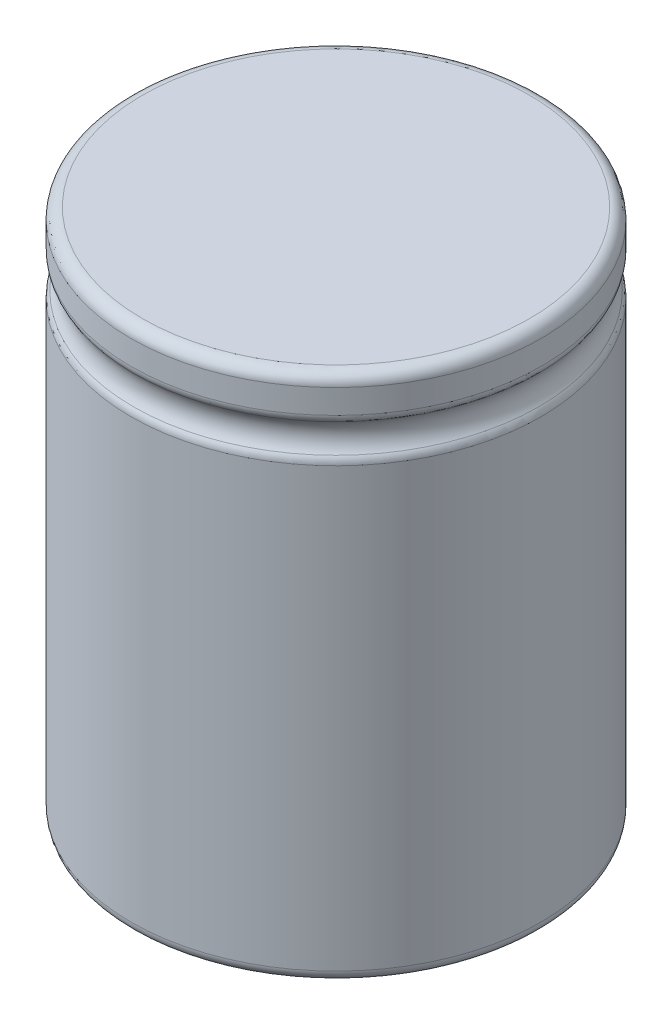
ISO-10303-21;
HEADER;
FILE_DESCRIPTION(('STEP AP214'),'2;1');
FILE_NAME('part.step','',(''),(''),'','','');
FILE_SCHEMA(('AUTOMOTIVE_DESIGN { 1 0 10303 214 1 1 1 1 }'));
ENDSEC;
DATA;
#1=APPLICATION_CONTEXT('core data for automotive mechanical design processes');
#2=APPLICATION_PROTOCOL_DEFINITION('international standard','automotive_design',2000,#1);
#3=PRODUCT_CONTEXT('',#1,'mechanical');
#4=PRODUCT('Part','Part','',(#3));
#5=PRODUCT_RELATED_PRODUCT_CATEGORY('part','',(#4));
#6=PRODUCT_DEFINITION_FORMATION('','',#4);
#7=PRODUCT_DEFINITION_CONTEXT('part definition',#1,'design');
#8=PRODUCT_DEFINITION('design','',#6,#7);
#9=PRODUCT_DEFINITION_SHAPE('','',#8);
#10=(LENGTH_UNIT() NAMED_UNIT(*) SI_UNIT(.MILLI.,.METRE.));
#11=(NAMED_UNIT(*) PLANE_ANGLE_UNIT() SI_UNIT($,.RADIAN.));
#12=(NAMED_UNIT(*) SI_UNIT($,.STERADIAN.) SOLID_ANGLE_UNIT());
#13=UNCERTAINTY_MEASURE_WITH_UNIT(LENGTH_MEASURE(1.E-05),#10,'distance_accuracy_value','');
#14=(GEOMETRIC_REPRESENTATION_CONTEXT(3) GLOBAL_UNCERTAINTY_ASSIGNED_CONTEXT((#13)) GLOBAL_UNIT_ASSIGNED_CONTEXT((#10,
#11,#12)) REPRESENTATION_CONTEXT('',''));
#15=CARTESIAN_POINT('',(0.,0.,0.));
#16=DIRECTION('',(0.,0.,1.));
#17=DIRECTION('',(1.,0.,0.));
#18=AXIS2_PLACEMENT_3D('',#15,#16,#17);
#19=CARTESIAN_POINT('',(0.,46.,0.));
#20=DIRECTION('',(0.,-1.,0.));
#21=DIRECTION('',(0.,0.,-1.));
#22=AXIS2_PLACEMENT_3D('',#19,#20,#21);
#23=CYLINDRICAL_SURFACE('',#22,17.85);
#24=CARTESIAN_POINT('',(0.,39.1015141062033,0.));
#25=DIRECTION('',(0.,1.,0.));
#26=DIRECTION('',(0.,0.,1.));
#27=AXIS2_PLACEMENT_3D('',#24,#25,#26);
#28=CIRCLE('',#27,17.85);
#29=CARTESIAN_POINT('',(0.,39.1015141062033,17.85));
#30=VERTEX_POINT('',#29);
#31=EDGE_CURVE('E48',#30,#30,#28,.F.);
#32=ORIENTED_EDGE('',*,*,#31,.T.);
#33=EDGE_LOOP('',(#32));
#34=FACE_BOUND('',#33,.T.);
#35=CARTESIAN_POINT('',(0.,1.,0.));
#36=DIRECTION('',(0.,1.,0.));
#37=DIRECTION('',(0.,0.,1.));
#38=AXIS2_PLACEMENT_3D('',#35,#36,#37);
#39=CIRCLE('',#38,17.85);
#40=CARTESIAN_POINT('',(0.,1.,17.85));
#41=VERTEX_POINT('',#40);
#42=EDGE_CURVE('E62',#41,#41,#39,.T.);
#43=ORIENTED_EDGE('',*,*,#42,.T.);
#44=EDGE_LOOP('',(#43));
#45=FACE_BOUND('',#44,.T.);
#46=ADVANCED_FACE('F33',(#34,#45),#23,.T.);
#47=CARTESIAN_POINT('',(0.,0.,0.));
#48=DIRECTION('',(0.,1.,0.));
#49=DIRECTION('',(0.,0.,1.));
#50=AXIS2_PLACEMENT_3D('',#47,#48,#49);
#51=PLANE('',#50);
#52=CARTESIAN_POINT('',(0.,0.,0.));
#53=DIRECTION('',(0.,1.,0.));
#54=DIRECTION('',(0.,0.,1.));
#55=AXIS2_PLACEMENT_3D('',#52,#53,#54);
#56=CIRCLE('',#55,16.85);
#57=CARTESIAN_POINT('',(0.,0.,16.85));
#58=VERTEX_POINT('',#57);
#59=EDGE_CURVE('E59',#58,#58,#56,.F.);
#60=ORIENTED_EDGE('',*,*,#59,.T.);
#61=EDGE_LOOP('',(#60));
#62=FACE_BOUND('',#61,.T.);
#63=ADVANCED_FACE('F84',(#62),#51,.F.);
#64=CARTESIAN_POINT('',(0.,41.,0.));
#65=DIRECTION('',(0.,-1.,0.));
#66=DIRECTION('',(0.,0.,-1.));
#67=AXIS2_PLACEMENT_3D('',#64,#65,#66);
#68=TOROIDAL_SURFACE('',#67,19.1728756555323,2.00000000000001);
#69=CARTESIAN_POINT('',(0.,39.7343427374693,0.));
#70=DIRECTION('',(0.,1.,0.));
#71=DIRECTION('',(0.,0.,1.));
#72=AXIS2_PLACEMENT_3D('',#69,#70,#71);
#73=CIRCLE('',#72,17.6242918851784);
#74=CARTESIAN_POINT('',(0.,39.7343427374693,17.6242918851784));
#75=VERTEX_POINT('',#74);
#76=EDGE_CURVE('E40',#75,#75,#73,.T.);
#77=ORIENTED_EDGE('',*,*,#76,.T.);
#78=EDGE_LOOP('',(#77));
#79=FACE_BOUND('',#78,.T.);
#80=CARTESIAN_POINT('',(0.,42.2656572625307,0.));
#81=DIRECTION('',(0.,-1.,0.));
#82=DIRECTION('',(0.,0.,-1.));
#83=AXIS2_PLACEMENT_3D('',#80,#81,#82);
#84=CIRCLE('',#83,17.6242918851785);
#85=CARTESIAN_POINT('',(0.,42.2656572625307,-17.6242918851785));
#86=VERTEX_POINT('',#85);
#87=EDGE_CURVE('E44',#86,#86,#84,.T.);
#88=ORIENTED_EDGE('',*,*,#87,.T.);
#89=EDGE_LOOP('',(#88));
#90=FACE_BOUND('',#89,.T.);
#91=ADVANCED_FACE('F89',(#79,#90),#68,.F.);
#92=CARTESIAN_POINT('',(0.,46.,0.));
#93=DIRECTION('',(0.,1.,0.));
#94=DIRECTION('',(0.,0.,1.));
#95=AXIS2_PLACEMENT_3D('',#92,#93,#94);
#96=PLANE('',#95);
#97=CARTESIAN_POINT('',(0.,46.,0.));
#98=DIRECTION('',(0.,1.,0.));
#99=DIRECTION('',(0.,0.,1.));
#100=AXIS2_PLACEMENT_3D('',#97,#98,#99);
#101=CIRCLE('',#100,16.85);
#102=CARTESIAN_POINT('',(0.,46.,16.85));
#103=VERTEX_POINT('',#102);
#104=EDGE_CURVE('E56',#103,#103,#101,.T.);
#105=ORIENTED_EDGE('',*,*,#104,.T.);
#106=EDGE_LOOP('',(#105));
#107=FACE_BOUND('',#106,.T.);
#108=ADVANCED_FACE('F80',(#107),#96,.T.);
#109=CARTESIAN_POINT('',(0.,42.8984858937966,0.));
#110=DIRECTION('',(0.,1.,0.));
#111=DIRECTION('',(0.,0.,1.));
#112=AXIS2_PLACEMENT_3D('',#109,#110,#111);
#113=CIRCLE('',#112,17.85);
#114=CARTESIAN_POINT('',(0.,42.8984858937966,17.85));
#115=VERTEX_POINT('',#114);
#116=EDGE_CURVE('E10',#115,#115,#113,.T.);
#117=ORIENTED_EDGE('',*,*,#116,.T.);
#118=EDGE_LOOP('',(#117));
#119=FACE_BOUND('',#118,.T.);
#120=CARTESIAN_POINT('',(0.,45.,0.));
#121=DIRECTION('',(0.,1.,0.));
#122=DIRECTION('',(0.,0.,1.));
#123=AXIS2_PLACEMENT_3D('',#120,#121,#122);
#124=CIRCLE('',#123,17.85);
#125=CARTESIAN_POINT('',(0.,45.,17.85));
#126=VERTEX_POINT('',#125);
#127=EDGE_CURVE('E53',#126,#126,#124,.F.);
#128=ORIENTED_EDGE('',*,*,#127,.T.);
#129=EDGE_LOOP('',(#128));
#130=FACE_BOUND('',#129,.T.);
#131=ADVANCED_FACE('F70',(#119,#130),#23,.T.);
#132=CARTESIAN_POINT('',(0.,1.,0.));
#133=DIRECTION('',(0.,1.,0.));
#134=DIRECTION('',(0.,0.,1.));
#135=AXIS2_PLACEMENT_3D('',#132,#133,#134);
#136=TOROIDAL_SURFACE('',#135,16.85,1.);
#137=ORIENTED_EDGE('',*,*,#59,.F.);
#138=EDGE_LOOP('',(#137));
#139=FACE_BOUND('',#138,.T.);
#140=ORIENTED_EDGE('',*,*,#42,.F.);
#141=EDGE_LOOP('',(#140));
#142=FACE_BOUND('',#141,.T.);
#143=ADVANCED_FACE('F67',(#139,#142),#136,.T.);
#144=CARTESIAN_POINT('',(0.,45.,0.));
#145=DIRECTION('',(0.,1.,0.));
#146=DIRECTION('',(0.,0.,1.));
#147=AXIS2_PLACEMENT_3D('',#144,#145,#146);
#148=TOROIDAL_SURFACE('',#147,16.85,1.);
#149=ORIENTED_EDGE('',*,*,#127,.F.);
#150=EDGE_LOOP('',(#149));
#151=FACE_BOUND('',#150,.T.);
#152=ORIENTED_EDGE('',*,*,#104,.F.);
#153=EDGE_LOOP('',(#152));
#154=FACE_BOUND('',#153,.T.);
#155=ADVANCED_FACE('F69',(#151,#154),#148,.T.);
#156=CARTESIAN_POINT('',(0.,39.1015141062033,0.));
#157=DIRECTION('',(0.,1.,0.));
#158=DIRECTION('',(0.,0.,1.));
#159=AXIS2_PLACEMENT_3D('',#156,#157,#158);
#160=TOROIDAL_SURFACE('',#159,16.8500000000008,1.);
#161=ORIENTED_EDGE('',*,*,#76,.F.);
#162=EDGE_LOOP('',(#161));
#163=FACE_BOUND('',#162,.T.);
#164=ORIENTED_EDGE('',*,*,#31,.F.);
#165=EDGE_LOOP('',(#164));
#166=FACE_BOUND('',#165,.T.);
#167=ADVANCED_FACE('F77',(#163,#166),#160,.T.);
#168=CARTESIAN_POINT('',(0.,42.8984858937966,0.));
#169=DIRECTION('',(0.,1.,0.));
#170=DIRECTION('',(0.,0.,1.));
#171=AXIS2_PLACEMENT_3D('',#168,#169,#170);
#172=TOROIDAL_SURFACE('',#171,16.8500000000008,1.);
#173=ORIENTED_EDGE('',*,*,#116,.F.);
#174=EDGE_LOOP('',(#173));
#175=FACE_BOUND('',#174,.T.);
#176=ORIENTED_EDGE('',*,*,#87,.F.);
#177=EDGE_LOOP('',(#176));
#178=FACE_BOUND('',#177,.T.);
#179=ADVANCED_FACE('F35',(#175,#178),#172,.T.);
#180=CLOSED_SHELL('',(#46,#63,#91,#108,#131,#143,#155,#167,#179));
#181=MANIFOLD_SOLID_BREP('B2',#180);
#182=ADVANCED_BREP_SHAPE_REPRESENTATION('',(#18,#181),#14);
#183=SHAPE_DEFINITION_REPRESENTATION(#9,#182);
ENDSEC;
END-ISO-10303-21;
